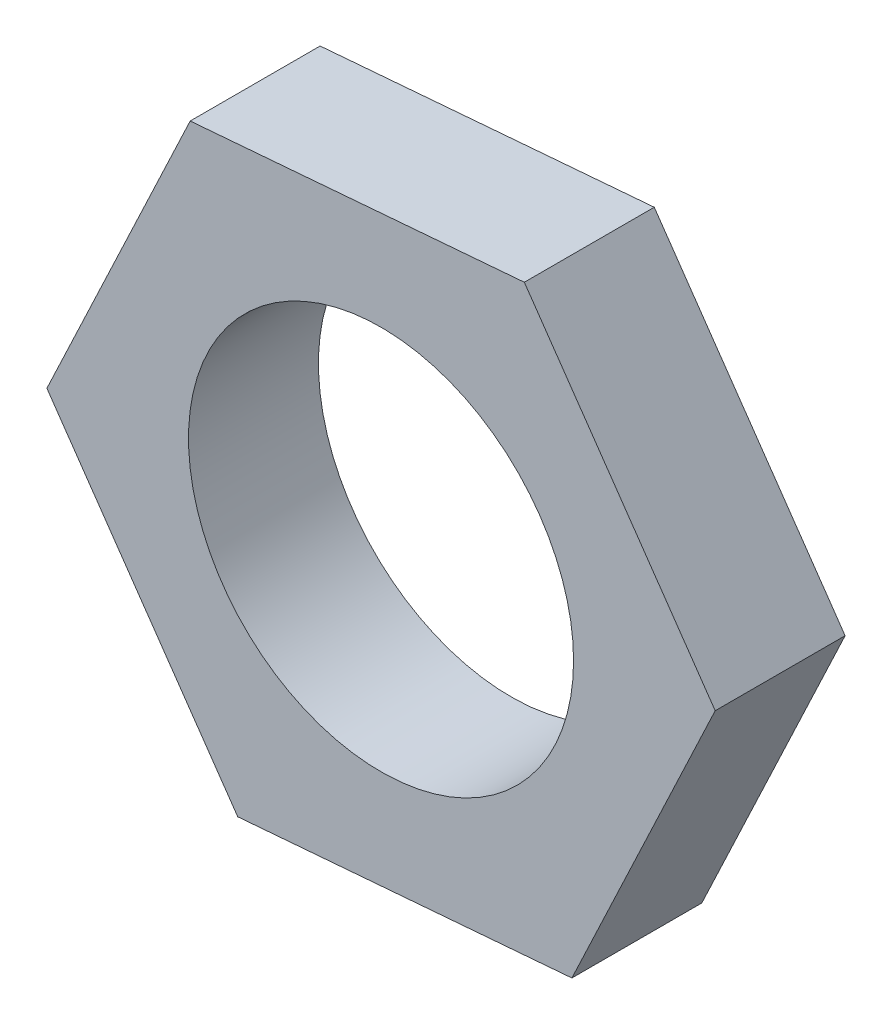
ISO-10303-21;
HEADER;
FILE_DESCRIPTION(('STEP AP214'),'2;1');
FILE_NAME('part.step','',(''),(''),'','','');
FILE_SCHEMA(('AUTOMOTIVE_DESIGN { 1 0 10303 214 1 1 1 1 }'));
ENDSEC;
DATA;
#1=APPLICATION_CONTEXT('core data for automotive mechanical design processes');
#2=APPLICATION_PROTOCOL_DEFINITION('international standard','automotive_design',2000,#1);
#3=PRODUCT_CONTEXT('',#1,'mechanical');
#4=PRODUCT('Part','Part','',(#3));
#5=PRODUCT_RELATED_PRODUCT_CATEGORY('part','',(#4));
#6=PRODUCT_DEFINITION_FORMATION('','',#4);
#7=PRODUCT_DEFINITION_CONTEXT('part definition',#1,'design');
#8=PRODUCT_DEFINITION('design','',#6,#7);
#9=PRODUCT_DEFINITION_SHAPE('','',#8);
#10=(LENGTH_UNIT() NAMED_UNIT(*) SI_UNIT(.MILLI.,.METRE.));
#11=(NAMED_UNIT(*) PLANE_ANGLE_UNIT() SI_UNIT($,.RADIAN.));
#12=(NAMED_UNIT(*) SI_UNIT($,.STERADIAN.) SOLID_ANGLE_UNIT());
#13=UNCERTAINTY_MEASURE_WITH_UNIT(LENGTH_MEASURE(1.E-05),#10,'distance_accuracy_value','');
#14=(GEOMETRIC_REPRESENTATION_CONTEXT(3) GLOBAL_UNCERTAINTY_ASSIGNED_CONTEXT((#13)) GLOBAL_UNIT_ASSIGNED_CONTEXT((#10,
#11,#12)) REPRESENTATION_CONTEXT('',''));
#15=CARTESIAN_POINT('',(0.,0.,0.));
#16=DIRECTION('',(0.,0.,1.));
#17=DIRECTION('',(1.,0.,0.));
#18=AXIS2_PLACEMENT_3D('',#15,#16,#17);
#19=CARTESIAN_POINT('',(3.41924394136273,7.23248027093432,3.1));
#20=DIRECTION('',(0.081886002563876,-0.996641702210031,0.));
#21=DIRECTION('',(0.996641702210032,0.081886002563876,0.));
#22=AXIS2_PLACEMENT_3D('',#19,#20,#21);
#23=PLANE('',#22);
#24=DIRECTION('',(-0.996641702210031,-0.081886002563876,0.));
#25=VECTOR('',#24,1.);
#26=CARTESIAN_POINT('',(3.41924394136273,7.23248027093432,0.));
#27=LINE('',#26,#25);
#28=CARTESIAN_POINT('',(3.41924394136273,7.23248027093432,0.));
#29=VERTEX_POINT('',#28);
#30=CARTESIAN_POINT('',(-4.55388967631751,6.57739225042332,0.));
#31=VERTEX_POINT('',#30);
#32=EDGE_CURVE('E116',#29,#31,#27,.T.);
#33=ORIENTED_EDGE('',*,*,#32,.T.);
#34=DIRECTION('',(0.,0.,-1.));
#35=VECTOR('',#34,1.);
#36=CARTESIAN_POINT('',(-4.55388967631751,6.57739225042332,3.1));
#37=LINE('',#36,#35);
#38=CARTESIAN_POINT('',(-4.55388967631751,6.57739225042332,3.1));
#39=VERTEX_POINT('',#38);
#40=EDGE_CURVE('E11',#39,#31,#37,.T.);
#41=ORIENTED_EDGE('',*,*,#40,.F.);
#42=DIRECTION('',(-0.996641702210031,-0.081886002563876,0.));
#43=VECTOR('',#42,1.);
#44=CARTESIAN_POINT('',(3.41924394136273,7.23248027093432,3.1));
#45=LINE('',#44,#43);
#46=CARTESIAN_POINT('',(3.41924394136273,7.23248027093432,3.1));
#47=VERTEX_POINT('',#46);
#48=EDGE_CURVE('E127',#47,#39,#45,.T.);
#49=ORIENTED_EDGE('',*,*,#48,.F.);
#50=DIRECTION('',(0.,0.,-1.));
#51=VECTOR('',#50,1.);
#52=CARTESIAN_POINT('',(3.41924394136273,7.23248027093432,3.1));
#53=LINE('',#52,#51);
#54=EDGE_CURVE('E112',#47,#29,#53,.T.);
#55=ORIENTED_EDGE('',*,*,#54,.T.);
#56=EDGE_LOOP('',(#33,#41,#49,#55));
#57=FACE_BOUND('',#56,.T.);
#58=ADVANCED_FACE('F32',(#57),#23,.F.);
#59=CARTESIAN_POINT('',(-4.55388967631751,6.57739225042332,3.1));
#60=DIRECTION('',(0.904060033866791,-0.427405492670342,0.));
#61=DIRECTION('',(0.427405492670342,0.904060033866791,0.));
#62=AXIS2_PLACEMENT_3D('',#59,#60,#61);
#63=PLANE('',#62);
#64=DIRECTION('',(-0.427405492670342,-0.904060033866791,0.));
#65=VECTOR('',#64,1.);
#66=CARTESIAN_POINT('',(-4.55388967631751,6.57739225042332,0.));
#67=LINE('',#66,#65);
#68=CARTESIAN_POINT('',(-7.97313361768025,-0.655088020511005,0.));
#69=VERTEX_POINT('',#68);
#70=EDGE_CURVE('E119',#31,#69,#67,.T.);
#71=ORIENTED_EDGE('',*,*,#70,.T.);
#72=DIRECTION('',(0.,0.,-1.));
#73=VECTOR('',#72,1.);
#74=CARTESIAN_POINT('',(-7.97313361768025,-0.655088020511005,3.1));
#75=LINE('',#74,#73);
#76=CARTESIAN_POINT('',(-7.97313361768025,-0.655088020511005,3.1));
#77=VERTEX_POINT('',#76);
#78=EDGE_CURVE('E40',#77,#69,#75,.T.);
#79=ORIENTED_EDGE('',*,*,#78,.F.);
#80=DIRECTION('',(-0.427405492670342,-0.904060033866791,0.));
#81=VECTOR('',#80,1.);
#82=CARTESIAN_POINT('',(-4.55388967631751,6.57739225042332,3.1));
#83=LINE('',#82,#81);
#84=EDGE_CURVE('E85',#39,#77,#83,.T.);
#85=ORIENTED_EDGE('',*,*,#84,.F.);
#86=ORIENTED_EDGE('',*,*,#40,.T.);
#87=EDGE_LOOP('',(#71,#79,#85,#86));
#88=FACE_BOUND('',#87,.T.);
#89=ADVANCED_FACE('F152',(#88),#63,.F.);
#90=CARTESIAN_POINT('',(-7.97313361768025,-0.655088020511005,3.1));
#91=DIRECTION('',(0.822174031302915,0.56923620953969,0.));
#92=DIRECTION('',(-0.56923620953969,0.822174031302915,0.));
#93=AXIS2_PLACEMENT_3D('',#90,#91,#92);
#94=PLANE('',#93);
#95=DIRECTION('',(0.56923620953969,-0.822174031302915,0.));
#96=VECTOR('',#95,1.);
#97=CARTESIAN_POINT('',(-7.97313361768025,-0.655088020511005,0.));
#98=LINE('',#97,#96);
#99=CARTESIAN_POINT('',(-3.41924394136273,-7.23248027093432,0.));
#100=VERTEX_POINT('',#99);
#101=EDGE_CURVE('E122',#69,#100,#98,.T.);
#102=ORIENTED_EDGE('',*,*,#101,.T.);
#103=DIRECTION('',(0.,0.,-1.));
#104=VECTOR('',#103,1.);
#105=CARTESIAN_POINT('',(-3.41924394136273,-7.23248027093432,3.1));
#106=LINE('',#105,#104);
#107=CARTESIAN_POINT('',(-3.41924394136273,-7.23248027093432,3.1));
#108=VERTEX_POINT('',#107);
#109=EDGE_CURVE('E107',#108,#100,#106,.T.);
#110=ORIENTED_EDGE('',*,*,#109,.F.);
#111=DIRECTION('',(0.56923620953969,-0.822174031302915,0.));
#112=VECTOR('',#111,1.);
#113=CARTESIAN_POINT('',(-7.97313361768025,-0.655088020511005,3.1));
#114=LINE('',#113,#112);
#115=EDGE_CURVE('E98',#77,#108,#114,.T.);
#116=ORIENTED_EDGE('',*,*,#115,.F.);
#117=ORIENTED_EDGE('',*,*,#78,.T.);
#118=EDGE_LOOP('',(#102,#110,#116,#117));
#119=FACE_BOUND('',#118,.T.);
#120=ADVANCED_FACE('F133',(#119),#94,.F.);
#121=CARTESIAN_POINT('',(-3.41924394136273,-7.23248027093432,3.1));
#122=DIRECTION('',(-0.0818860025638753,0.996641702210031,0.));
#123=DIRECTION('',(-0.996641702210031,-0.0818860025638753,0.));
#124=AXIS2_PLACEMENT_3D('',#121,#122,#123);
#125=PLANE('',#124);
#126=DIRECTION('',(0.996641702210031,0.0818860025638753,0.));
#127=VECTOR('',#126,1.);
#128=CARTESIAN_POINT('',(-3.41924394136273,-7.23248027093432,0.));
#129=LINE('',#128,#127);
#130=CARTESIAN_POINT('',(4.55388967631752,-6.57739225042332,0.));
#131=VERTEX_POINT('',#130);
#132=EDGE_CURVE('E106',#100,#131,#129,.T.);
#133=ORIENTED_EDGE('',*,*,#132,.T.);
#134=DIRECTION('',(0.,0.,-1.));
#135=VECTOR('',#134,1.);
#136=CARTESIAN_POINT('',(4.55388967631752,-6.57739225042332,3.1));
#137=LINE('',#136,#135);
#138=CARTESIAN_POINT('',(4.55388967631752,-6.57739225042332,3.1));
#139=VERTEX_POINT('',#138);
#140=EDGE_CURVE('E103',#139,#131,#137,.T.);
#141=ORIENTED_EDGE('',*,*,#140,.F.);
#142=DIRECTION('',(0.996641702210031,0.0818860025638753,0.));
#143=VECTOR('',#142,1.);
#144=CARTESIAN_POINT('',(-3.41924394136273,-7.23248027093432,3.1));
#145=LINE('',#144,#143);
#146=EDGE_CURVE('E92',#108,#139,#145,.T.);
#147=ORIENTED_EDGE('',*,*,#146,.F.);
#148=ORIENTED_EDGE('',*,*,#109,.T.);
#149=EDGE_LOOP('',(#133,#141,#147,#148));
#150=FACE_BOUND('',#149,.T.);
#151=ADVANCED_FACE('F104',(#150),#125,.F.);
#152=CARTESIAN_POINT('',(4.55388967631752,-6.57739225042332,3.1));
#153=DIRECTION('',(-0.904060033866791,0.427405492670341,0.));
#154=DIRECTION('',(-0.427405492670341,-0.904060033866791,0.));
#155=AXIS2_PLACEMENT_3D('',#152,#153,#154);
#156=PLANE('',#155);
#157=DIRECTION('',(0.427405492670342,0.904060033866791,0.));
#158=VECTOR('',#157,1.);
#159=CARTESIAN_POINT('',(4.55388967631752,-6.57739225042332,0.));
#160=LINE('',#159,#158);
#161=CARTESIAN_POINT('',(7.97313361768025,0.655088020511008,0.));
#162=VERTEX_POINT('',#161);
#163=EDGE_CURVE('E71',#131,#162,#160,.T.);
#164=ORIENTED_EDGE('',*,*,#163,.T.);
#165=DIRECTION('',(0.,0.,-1.));
#166=VECTOR('',#165,1.);
#167=CARTESIAN_POINT('',(7.97313361768025,0.655088020511008,3.1));
#168=LINE('',#167,#166);
#169=CARTESIAN_POINT('',(7.97313361768025,0.655088020511008,3.1));
#170=VERTEX_POINT('',#169);
#171=EDGE_CURVE('E108',#170,#162,#168,.T.);
#172=ORIENTED_EDGE('',*,*,#171,.F.);
#173=DIRECTION('',(0.427405492670342,0.904060033866791,0.));
#174=VECTOR('',#173,1.);
#175=CARTESIAN_POINT('',(4.55388967631752,-6.57739225042332,3.1));
#176=LINE('',#175,#174);
#177=EDGE_CURVE('E96',#139,#170,#176,.T.);
#178=ORIENTED_EDGE('',*,*,#177,.F.);
#179=ORIENTED_EDGE('',*,*,#140,.T.);
#180=EDGE_LOOP('',(#164,#172,#178,#179));
#181=FACE_BOUND('',#180,.T.);
#182=ADVANCED_FACE('F110',(#181),#156,.F.);
#183=CARTESIAN_POINT('',(7.97313361768025,0.655088020511008,3.1));
#184=DIRECTION('',(-0.822174031302915,-0.56923620953969,0.));
#185=DIRECTION('',(0.56923620953969,-0.822174031302915,0.));
#186=AXIS2_PLACEMENT_3D('',#183,#184,#185);
#187=PLANE('',#186);
#188=DIRECTION('',(-0.56923620953969,0.822174031302915,0.));
#189=VECTOR('',#188,1.);
#190=CARTESIAN_POINT('',(7.97313361768025,0.655088020511008,0.));
#191=LINE('',#190,#189);
#192=EDGE_CURVE('E77',#162,#29,#191,.T.);
#193=ORIENTED_EDGE('',*,*,#192,.T.);
#194=ORIENTED_EDGE('',*,*,#54,.F.);
#195=DIRECTION('',(-0.56923620953969,0.822174031302915,0.));
#196=VECTOR('',#195,1.);
#197=CARTESIAN_POINT('',(7.97313361768025,0.655088020511008,3.1));
#198=LINE('',#197,#196);
#199=EDGE_CURVE('E48',#170,#47,#198,.T.);
#200=ORIENTED_EDGE('',*,*,#199,.F.);
#201=ORIENTED_EDGE('',*,*,#171,.T.);
#202=EDGE_LOOP('',(#193,#194,#200,#201));
#203=FACE_BOUND('',#202,.T.);
#204=ADVANCED_FACE('F140',(#203),#187,.F.);
#205=CARTESIAN_POINT('',(0.,0.,3.1));
#206=DIRECTION('',(0.,0.,1.));
#207=DIRECTION('',(1.,0.,0.));
#208=AXIS2_PLACEMENT_3D('',#205,#206,#207);
#209=PLANE('',#208);
#210=CARTESIAN_POINT('',(0.,0.,3.1));
#211=DIRECTION('',(0.,0.,1.));
#212=DIRECTION('',(1.,0.,0.));
#213=AXIS2_PLACEMENT_3D('',#210,#211,#212);
#214=CIRCLE('',#213,4.594);
#215=CARTESIAN_POINT('',(4.594,0.,3.1));
#216=VERTEX_POINT('',#215);
#217=EDGE_CURVE('E207',#216,#216,#214,.T.);
#218=ORIENTED_EDGE('',*,*,#217,.F.);
#219=EDGE_LOOP('',(#218));
#220=FACE_BOUND('',#219,.T.);
#221=ORIENTED_EDGE('',*,*,#48,.T.);
#222=ORIENTED_EDGE('',*,*,#84,.T.);
#223=ORIENTED_EDGE('',*,*,#115,.T.);
#224=ORIENTED_EDGE('',*,*,#146,.T.);
#225=ORIENTED_EDGE('',*,*,#177,.T.);
#226=ORIENTED_EDGE('',*,*,#199,.T.);
#227=EDGE_LOOP('',(#221,#222,#223,#224,#225,#226));
#228=FACE_BOUND('',#227,.T.);
#229=ADVANCED_FACE('F94',(#220,#228),#209,.T.);
#230=CARTESIAN_POINT('',(0.,0.,0.));
#231=DIRECTION('',(0.,0.,1.));
#232=DIRECTION('',(1.,0.,0.));
#233=AXIS2_PLACEMENT_3D('',#230,#231,#232);
#234=PLANE('',#233);
#235=CARTESIAN_POINT('',(0.,0.,0.));
#236=DIRECTION('',(0.,0.,1.));
#237=DIRECTION('',(1.,0.,0.));
#238=AXIS2_PLACEMENT_3D('',#235,#236,#237);
#239=CIRCLE('',#238,4.594);
#240=CARTESIAN_POINT('',(4.594,0.,0.));
#241=VERTEX_POINT('',#240);
#242=EDGE_CURVE('E120',#241,#241,#239,.T.);
#243=ORIENTED_EDGE('',*,*,#242,.T.);
#244=EDGE_LOOP('',(#243));
#245=FACE_BOUND('',#244,.T.);
#246=ORIENTED_EDGE('',*,*,#32,.F.);
#247=ORIENTED_EDGE('',*,*,#192,.F.);
#248=ORIENTED_EDGE('',*,*,#163,.F.);
#249=ORIENTED_EDGE('',*,*,#132,.F.);
#250=ORIENTED_EDGE('',*,*,#101,.F.);
#251=ORIENTED_EDGE('',*,*,#70,.F.);
#252=EDGE_LOOP('',(#246,#247,#248,#249,#250,#251));
#253=FACE_BOUND('',#252,.T.);
#254=ADVANCED_FACE('F136',(#245,#253),#234,.F.);
#255=CARTESIAN_POINT('',(0.,0.,0.));
#256=DIRECTION('',(0.,0.,1.));
#257=DIRECTION('',(1.,0.,0.));
#258=AXIS2_PLACEMENT_3D('',#255,#256,#257);
#259=CYLINDRICAL_SURFACE('',#258,4.594);
#260=ORIENTED_EDGE('',*,*,#242,.F.);
#261=EDGE_LOOP('',(#260));
#262=FACE_BOUND('',#261,.T.);
#263=ORIENTED_EDGE('',*,*,#217,.T.);
#264=EDGE_LOOP('',(#263));
#265=FACE_BOUND('',#264,.T.);
#266=ADVANCED_FACE('F189',(#262,#265),#259,.F.);
#267=CLOSED_SHELL('',(#58,#89,#120,#151,#182,#204,#229,#254,#266));
#268=MANIFOLD_SOLID_BREP('B2',#267);
#269=ADVANCED_BREP_SHAPE_REPRESENTATION('',(#18,#268),#14);
#270=SHAPE_DEFINITION_REPRESENTATION(#9,#269);
ENDSEC;
END-ISO-10303-21;
